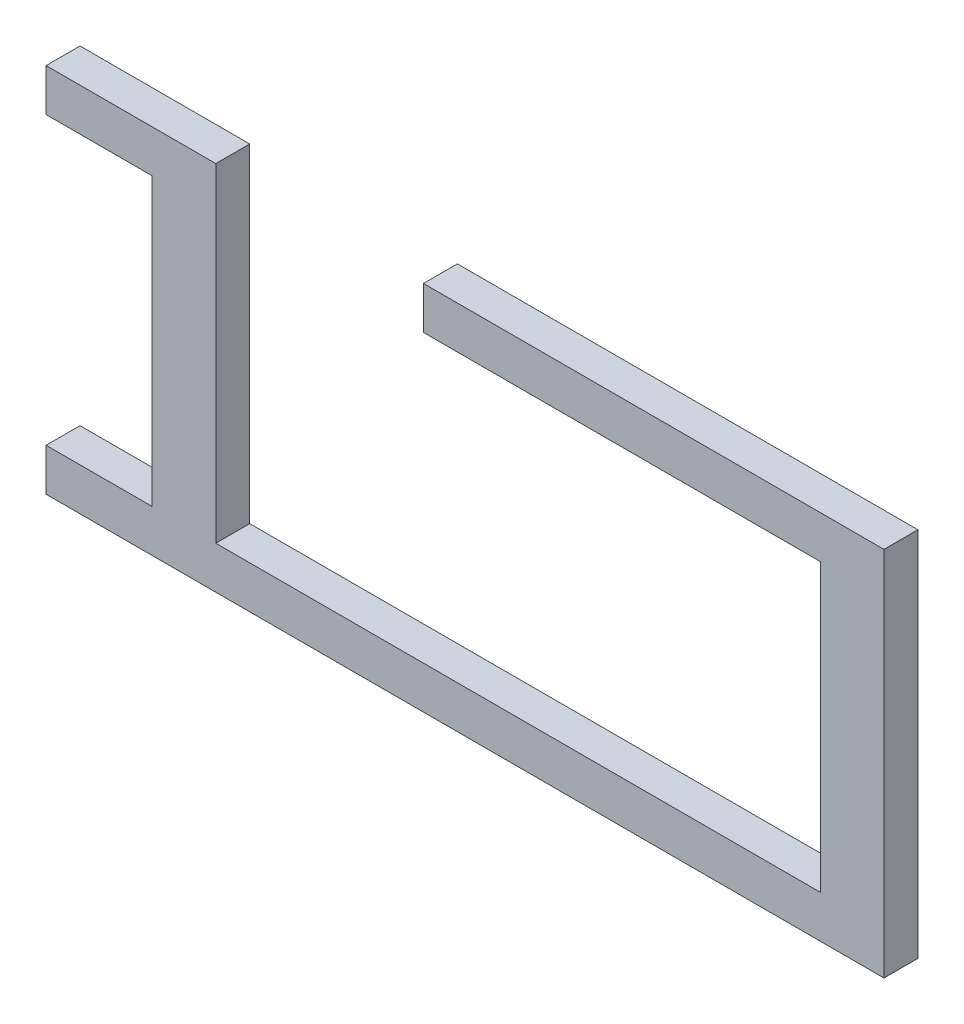
ISO-10303-21;
HEADER;
FILE_DESCRIPTION(('STEP AP214'),'2;1');
FILE_NAME('part.step','',(''),(''),'','','');
FILE_SCHEMA(('AUTOMOTIVE_DESIGN { 1 0 10303 214 1 1 1 1 }'));
ENDSEC;
DATA;
#1=APPLICATION_CONTEXT('core data for automotive mechanical design processes');
#2=APPLICATION_PROTOCOL_DEFINITION('international standard','automotive_design',2000,#1);
#3=PRODUCT_CONTEXT('',#1,'mechanical');
#4=PRODUCT('Part','Part','',(#3));
#5=PRODUCT_RELATED_PRODUCT_CATEGORY('part','',(#4));
#6=PRODUCT_DEFINITION_FORMATION('','',#4);
#7=PRODUCT_DEFINITION_CONTEXT('part definition',#1,'design');
#8=PRODUCT_DEFINITION('design','',#6,#7);
#9=PRODUCT_DEFINITION_SHAPE('','',#8);
#10=(LENGTH_UNIT() NAMED_UNIT(*) SI_UNIT(.MILLI.,.METRE.));
#11=(NAMED_UNIT(*) PLANE_ANGLE_UNIT() SI_UNIT($,.RADIAN.));
#12=(NAMED_UNIT(*) SI_UNIT($,.STERADIAN.) SOLID_ANGLE_UNIT());
#13=UNCERTAINTY_MEASURE_WITH_UNIT(LENGTH_MEASURE(1.E-05),#10,'distance_accuracy_value','');
#14=(GEOMETRIC_REPRESENTATION_CONTEXT(3) GLOBAL_UNCERTAINTY_ASSIGNED_CONTEXT((#13)) GLOBAL_UNIT_ASSIGNED_CONTEXT((#10,
#11,#12)) REPRESENTATION_CONTEXT('',''));
#15=CARTESIAN_POINT('',(0.,0.,0.));
#16=DIRECTION('',(0.,0.,1.));
#17=DIRECTION('',(1.,0.,0.));
#18=AXIS2_PLACEMENT_3D('',#15,#16,#17);
#19=CARTESIAN_POINT('',(14.6596099929362,3.20477089033923,1.6));
#20=DIRECTION('',(1.,0.,0.));
#21=DIRECTION('',(0.,1.,0.));
#22=AXIS2_PLACEMENT_3D('',#19,#20,#21);
#23=PLANE('',#22);
#24=DIRECTION('',(0.,-1.,0.));
#25=VECTOR('',#24,1.);
#26=CARTESIAN_POINT('',(14.6596099929362,3.20477089033923,0.));
#27=LINE('',#26,#25);
#28=CARTESIAN_POINT('',(14.6596099929362,3.20477089033923,0.));
#29=VERTEX_POINT('',#28);
#30=CARTESIAN_POINT('',(14.6596099929362,1.20477089033923,0.));
#31=VERTEX_POINT('',#30);
#32=EDGE_CURVE('E171',#29,#31,#27,.T.);
#33=ORIENTED_EDGE('',*,*,#32,.T.);
#34=DIRECTION('',(0.,0.,-1.));
#35=VECTOR('',#34,1.);
#36=CARTESIAN_POINT('',(14.6596099929362,1.20477089033923,1.6));
#37=LINE('',#36,#35);
#38=CARTESIAN_POINT('',(14.6596099929362,1.20477089033923,1.6));
#39=VERTEX_POINT('',#38);
#40=EDGE_CURVE('E11',#39,#31,#37,.T.);
#41=ORIENTED_EDGE('',*,*,#40,.F.);
#42=DIRECTION('',(0.,-1.,0.));
#43=VECTOR('',#42,1.);
#44=CARTESIAN_POINT('',(14.6596099929362,3.20477089033923,1.6));
#45=LINE('',#44,#43);
#46=CARTESIAN_POINT('',(14.6596099929362,3.20477089033923,1.6));
#47=VERTEX_POINT('',#46);
#48=EDGE_CURVE('E197',#47,#39,#45,.T.);
#49=ORIENTED_EDGE('',*,*,#48,.F.);
#50=DIRECTION('',(0.,0.,-1.));
#51=VECTOR('',#50,1.);
#52=CARTESIAN_POINT('',(14.6596099929362,3.20477089033923,1.6));
#53=LINE('',#52,#51);
#54=EDGE_CURVE('E167',#47,#29,#53,.T.);
#55=ORIENTED_EDGE('',*,*,#54,.T.);
#56=EDGE_LOOP('',(#33,#41,#49,#55));
#57=FACE_BOUND('',#56,.T.);
#58=ADVANCED_FACE('F39',(#57),#23,.F.);
#59=CARTESIAN_POINT('',(14.6596099929362,1.20477089033923,1.6));
#60=DIRECTION('',(0.,1.,0.));
#61=DIRECTION('',(0.,0.,1.));
#62=AXIS2_PLACEMENT_3D('',#59,#60,#61);
#63=PLANE('',#62);
#64=DIRECTION('',(1.,0.,0.));
#65=VECTOR('',#64,1.);
#66=CARTESIAN_POINT('',(14.6596099929362,1.20477089033923,0.));
#67=LINE('',#66,#65);
#68=CARTESIAN_POINT('',(33.3719358672992,1.20477089033923,0.));
#69=VERTEX_POINT('',#68);
#70=EDGE_CURVE('E174',#31,#69,#67,.T.);
#71=ORIENTED_EDGE('',*,*,#70,.T.);
#72=DIRECTION('',(0.,0.,-1.));
#73=VECTOR('',#72,1.);
#74=CARTESIAN_POINT('',(33.3719358672992,1.20477089033923,1.6));
#75=LINE('',#74,#73);
#76=CARTESIAN_POINT('',(33.3719358672992,1.20477089033923,1.6));
#77=VERTEX_POINT('',#76);
#78=EDGE_CURVE('E47',#77,#69,#75,.T.);
#79=ORIENTED_EDGE('',*,*,#78,.F.);
#80=DIRECTION('',(1.,0.,0.));
#81=VECTOR('',#80,1.);
#82=CARTESIAN_POINT('',(14.6596099929362,1.20477089033923,1.6));
#83=LINE('',#82,#81);
#84=EDGE_CURVE('E116',#39,#77,#83,.T.);
#85=ORIENTED_EDGE('',*,*,#84,.F.);
#86=ORIENTED_EDGE('',*,*,#40,.T.);
#87=EDGE_LOOP('',(#71,#79,#85,#86));
#88=FACE_BOUND('',#87,.T.);
#89=ADVANCED_FACE('F285',(#88),#63,.F.);
#90=CARTESIAN_POINT('',(33.3719358672992,1.20477089033923,1.6));
#91=DIRECTION('',(1.,0.,0.));
#92=DIRECTION('',(0.,0.,-1.));
#93=AXIS2_PLACEMENT_3D('',#90,#91,#92);
#94=PLANE('',#93);
#95=DIRECTION('',(0.,-1.,0.));
#96=VECTOR('',#95,1.);
#97=CARTESIAN_POINT('',(33.3719358672992,1.20477089033923,0.));
#98=LINE('',#97,#96);
#99=CARTESIAN_POINT('',(33.3719358672992,-12.2952291096608,0.));
#100=VERTEX_POINT('',#99);
#101=EDGE_CURVE('E176',#69,#100,#98,.T.);
#102=ORIENTED_EDGE('',*,*,#101,.T.);
#103=DIRECTION('',(0.,0.,-1.));
#104=VECTOR('',#103,1.);
#105=CARTESIAN_POINT('',(33.3719358672992,-12.2952291096608,1.6));
#106=LINE('',#105,#104);
#107=CARTESIAN_POINT('',(33.3719358672992,-12.2952291096608,1.6));
#108=VERTEX_POINT('',#107);
#109=EDGE_CURVE('E222',#108,#100,#106,.T.);
#110=ORIENTED_EDGE('',*,*,#109,.F.);
#111=DIRECTION('',(0.,-1.,0.));
#112=VECTOR('',#111,1.);
#113=CARTESIAN_POINT('',(33.3719358672992,1.20477089033923,1.6));
#114=LINE('',#113,#112);
#115=EDGE_CURVE('E230',#77,#108,#114,.T.);
#116=ORIENTED_EDGE('',*,*,#115,.F.);
#117=ORIENTED_EDGE('',*,*,#78,.T.);
#118=EDGE_LOOP('',(#102,#110,#116,#117));
#119=FACE_BOUND('',#118,.T.);
#120=ADVANCED_FACE('F228',(#119),#94,.F.);
#121=CARTESIAN_POINT('',(33.3719358672992,-12.2952291096608,1.6));
#122=DIRECTION('',(0.,-1.,0.));
#123=DIRECTION('',(1.,0.,0.));
#124=AXIS2_PLACEMENT_3D('',#121,#122,#123);
#125=PLANE('',#124);
#126=DIRECTION('',(-1.,0.,0.));
#127=VECTOR('',#126,1.);
#128=CARTESIAN_POINT('',(33.3719358672992,-12.2952291096608,0.));
#129=LINE('',#128,#127);
#130=CARTESIAN_POINT('',(4.87193586729921,-12.2952291096608,0.));
#131=VERTEX_POINT('',#130);
#132=EDGE_CURVE('E178',#100,#131,#129,.T.);
#133=ORIENTED_EDGE('',*,*,#132,.T.);
#134=DIRECTION('',(0.,0.,-1.));
#135=VECTOR('',#134,1.);
#136=CARTESIAN_POINT('',(4.87193586729921,-12.2952291096608,1.6));
#137=LINE('',#136,#135);
#138=CARTESIAN_POINT('',(4.87193586729921,-12.2952291096608,1.6));
#139=VERTEX_POINT('',#138);
#140=EDGE_CURVE('E219',#139,#131,#137,.T.);
#141=ORIENTED_EDGE('',*,*,#140,.F.);
#142=DIRECTION('',(-1.,0.,0.));
#143=VECTOR('',#142,1.);
#144=CARTESIAN_POINT('',(33.3719358672992,-12.2952291096608,1.6));
#145=LINE('',#144,#143);
#146=EDGE_CURVE('E248',#108,#139,#145,.T.);
#147=ORIENTED_EDGE('',*,*,#146,.F.);
#148=ORIENTED_EDGE('',*,*,#109,.T.);
#149=EDGE_LOOP('',(#133,#141,#147,#148));
#150=FACE_BOUND('',#149,.T.);
#151=ADVANCED_FACE('F239',(#150),#125,.F.);
#152=CARTESIAN_POINT('',(4.8719358672992,3.20477089033923,1.6));
#153=DIRECTION('',(-1.,0.,0.));
#154=DIRECTION('',(0.,-1.,0.));
#155=AXIS2_PLACEMENT_3D('',#152,#153,#154);
#156=PLANE('',#155);
#157=DIRECTION('',(0.,1.,0.));
#158=VECTOR('',#157,1.);
#159=CARTESIAN_POINT('',(4.8719358672992,3.20477089033923,0.));
#160=LINE('',#159,#158);
#161=CARTESIAN_POINT('',(4.8719358672992,3.20477089033923,0.));
#162=VERTEX_POINT('',#161);
#163=EDGE_CURVE('E180',#131,#162,#160,.T.);
#164=ORIENTED_EDGE('',*,*,#163,.T.);
#165=DIRECTION('',(0.,0.,-1.));
#166=VECTOR('',#165,1.);
#167=CARTESIAN_POINT('',(4.8719358672992,3.20477089033923,1.6));
#168=LINE('',#167,#166);
#169=CARTESIAN_POINT('',(4.8719358672992,3.20477089033923,1.6));
#170=VERTEX_POINT('',#169);
#171=EDGE_CURVE('E216',#170,#162,#168,.T.);
#172=ORIENTED_EDGE('',*,*,#171,.F.);
#173=DIRECTION('',(0.,1.,0.));
#174=VECTOR('',#173,1.);
#175=CARTESIAN_POINT('',(4.8719358672992,3.20477089033923,1.6));
#176=LINE('',#175,#174);
#177=EDGE_CURVE('E245',#139,#170,#176,.T.);
#178=ORIENTED_EDGE('',*,*,#177,.F.);
#179=ORIENTED_EDGE('',*,*,#140,.T.);
#180=EDGE_LOOP('',(#164,#172,#178,#179));
#181=FACE_BOUND('',#180,.T.);
#182=ADVANCED_FACE('F243',(#181),#156,.F.);
#183=CARTESIAN_POINT('',(-3.1280641327008,3.20477089033923,1.6));
#184=DIRECTION('',(0.,-1.,0.));
#185=DIRECTION('',(0.,0.,-1.));
#186=AXIS2_PLACEMENT_3D('',#183,#184,#185);
#187=PLANE('',#186);
#188=DIRECTION('',(-1.,0.,0.));
#189=VECTOR('',#188,1.);
#190=CARTESIAN_POINT('',(-3.1280641327008,3.20477089033923,0.));
#191=LINE('',#190,#189);
#192=CARTESIAN_POINT('',(-3.1280641327008,3.20477089033923,0.));
#193=VERTEX_POINT('',#192);
#194=EDGE_CURVE('E182',#162,#193,#191,.T.);
#195=ORIENTED_EDGE('',*,*,#194,.T.);
#196=DIRECTION('',(0.,0.,-1.));
#197=VECTOR('',#196,1.);
#198=CARTESIAN_POINT('',(-3.1280641327008,3.20477089033923,1.6));
#199=LINE('',#198,#197);
#200=CARTESIAN_POINT('',(-3.1280641327008,3.20477089033923,1.6));
#201=VERTEX_POINT('',#200);
#202=EDGE_CURVE('E213',#201,#193,#199,.T.);
#203=ORIENTED_EDGE('',*,*,#202,.F.);
#204=DIRECTION('',(-1.,0.,0.));
#205=VECTOR('',#204,1.);
#206=CARTESIAN_POINT('',(-3.1280641327008,3.20477089033923,1.6));
#207=LINE('',#206,#205);
#208=EDGE_CURVE('E247',#170,#201,#207,.T.);
#209=ORIENTED_EDGE('',*,*,#208,.F.);
#210=ORIENTED_EDGE('',*,*,#171,.T.);
#211=EDGE_LOOP('',(#195,#203,#209,#210));
#212=FACE_BOUND('',#211,.T.);
#213=ADVANCED_FACE('F298',(#212),#187,.F.);
#214=CARTESIAN_POINT('',(-3.1280641327008,3.20477089033923,1.6));
#215=DIRECTION('',(1.,0.,0.));
#216=DIRECTION('',(0.,0.,-1.));
#217=AXIS2_PLACEMENT_3D('',#214,#215,#216);
#218=PLANE('',#217);
#219=DIRECTION('',(0.,-1.,0.));
#220=VECTOR('',#219,1.);
#221=CARTESIAN_POINT('',(-3.1280641327008,3.20477089033923,0.));
#222=LINE('',#221,#220);
#223=CARTESIAN_POINT('',(-3.1280641327008,1.20477089033923,0.));
#224=VERTEX_POINT('',#223);
#225=EDGE_CURVE('E184',#193,#224,#222,.T.);
#226=ORIENTED_EDGE('',*,*,#225,.T.);
#227=DIRECTION('',(0.,0.,-1.));
#228=VECTOR('',#227,1.);
#229=CARTESIAN_POINT('',(-3.1280641327008,1.20477089033923,1.6));
#230=LINE('',#229,#228);
#231=CARTESIAN_POINT('',(-3.1280641327008,1.20477089033923,1.6));
#232=VERTEX_POINT('',#231);
#233=EDGE_CURVE('E210',#232,#224,#230,.T.);
#234=ORIENTED_EDGE('',*,*,#233,.F.);
#235=DIRECTION('',(0.,-1.,0.));
#236=VECTOR('',#235,1.);
#237=CARTESIAN_POINT('',(-3.1280641327008,3.20477089033923,1.6));
#238=LINE('',#237,#236);
#239=EDGE_CURVE('E250',#201,#232,#238,.T.);
#240=ORIENTED_EDGE('',*,*,#239,.F.);
#241=ORIENTED_EDGE('',*,*,#202,.T.);
#242=EDGE_LOOP('',(#226,#234,#240,#241));
#243=FACE_BOUND('',#242,.T.);
#244=ADVANCED_FACE('F301',(#243),#218,.F.);
#245=CARTESIAN_POINT('',(-3.1280641327008,1.20477089033923,1.6));
#246=DIRECTION('',(0.,1.,0.));
#247=DIRECTION('',(0.,0.,1.));
#248=AXIS2_PLACEMENT_3D('',#245,#246,#247);
#249=PLANE('',#248);
#250=DIRECTION('',(1.,0.,0.));
#251=VECTOR('',#250,1.);
#252=CARTESIAN_POINT('',(-3.1280641327008,1.20477089033923,0.));
#253=LINE('',#252,#251);
#254=CARTESIAN_POINT('',(1.8719358672992,1.20477089033923,0.));
#255=VERTEX_POINT('',#254);
#256=EDGE_CURVE('E186',#224,#255,#253,.T.);
#257=ORIENTED_EDGE('',*,*,#256,.T.);
#258=DIRECTION('',(0.,0.,-1.));
#259=VECTOR('',#258,1.);
#260=CARTESIAN_POINT('',(1.8719358672992,1.20477089033923,1.6));
#261=LINE('',#260,#259);
#262=CARTESIAN_POINT('',(1.8719358672992,1.20477089033923,1.6));
#263=VERTEX_POINT('',#262);
#264=EDGE_CURVE('E207',#263,#255,#261,.T.);
#265=ORIENTED_EDGE('',*,*,#264,.F.);
#266=DIRECTION('',(1.,0.,0.));
#267=VECTOR('',#266,1.);
#268=CARTESIAN_POINT('',(-3.1280641327008,1.20477089033923,1.6));
#269=LINE('',#268,#267);
#270=EDGE_CURVE('E256',#232,#263,#269,.T.);
#271=ORIENTED_EDGE('',*,*,#270,.F.);
#272=ORIENTED_EDGE('',*,*,#233,.T.);
#273=EDGE_LOOP('',(#257,#265,#271,#272));
#274=FACE_BOUND('',#273,.T.);
#275=ADVANCED_FACE('F305',(#274),#249,.F.);
#276=CARTESIAN_POINT('',(1.8719358672992,1.20477089033923,1.6));
#277=DIRECTION('',(1.,0.,0.));
#278=DIRECTION('',(0.,1.,0.));
#279=AXIS2_PLACEMENT_3D('',#276,#277,#278);
#280=PLANE('',#279);
#281=DIRECTION('',(0.,-1.,0.));
#282=VECTOR('',#281,1.);
#283=CARTESIAN_POINT('',(1.8719358672992,1.20477089033923,0.));
#284=LINE('',#283,#282);
#285=CARTESIAN_POINT('',(1.87193586729921,-12.2952291096608,0.));
#286=VERTEX_POINT('',#285);
#287=EDGE_CURVE('E188',#255,#286,#284,.T.);
#288=ORIENTED_EDGE('',*,*,#287,.T.);
#289=DIRECTION('',(0.,0.,-1.));
#290=VECTOR('',#289,1.);
#291=CARTESIAN_POINT('',(1.87193586729921,-12.2952291096608,1.6));
#292=LINE('',#291,#290);
#293=CARTESIAN_POINT('',(1.87193586729921,-12.2952291096608,1.6));
#294=VERTEX_POINT('',#293);
#295=EDGE_CURVE('E204',#294,#286,#292,.T.);
#296=ORIENTED_EDGE('',*,*,#295,.F.);
#297=DIRECTION('',(0.,-1.,0.));
#298=VECTOR('',#297,1.);
#299=CARTESIAN_POINT('',(1.8719358672992,1.20477089033923,1.6));
#300=LINE('',#299,#298);
#301=EDGE_CURVE('E258',#263,#294,#300,.T.);
#302=ORIENTED_EDGE('',*,*,#301,.F.);
#303=ORIENTED_EDGE('',*,*,#264,.T.);
#304=EDGE_LOOP('',(#288,#296,#302,#303));
#305=FACE_BOUND('',#304,.T.);
#306=ADVANCED_FACE('F309',(#305),#280,.F.);
#307=CARTESIAN_POINT('',(1.87193586729921,-12.2952291096608,1.6));
#308=DIRECTION('',(0.,-1.,0.));
#309=DIRECTION('',(1.,0.,0.));
#310=AXIS2_PLACEMENT_3D('',#307,#308,#309);
#311=PLANE('',#310);
#312=DIRECTION('',(-1.,0.,0.));
#313=VECTOR('',#312,1.);
#314=CARTESIAN_POINT('',(1.87193586729921,-12.2952291096608,0.));
#315=LINE('',#314,#313);
#316=CARTESIAN_POINT('',(-3.1280641327008,-12.2952291096608,0.));
#317=VERTEX_POINT('',#316);
#318=EDGE_CURVE('E190',#286,#317,#315,.T.);
#319=ORIENTED_EDGE('',*,*,#318,.T.);
#320=DIRECTION('',(0.,0.,-1.));
#321=VECTOR('',#320,1.);
#322=CARTESIAN_POINT('',(-3.1280641327008,-12.2952291096608,1.6));
#323=LINE('',#322,#321);
#324=CARTESIAN_POINT('',(-3.1280641327008,-12.2952291096608,1.6));
#325=VERTEX_POINT('',#324);
#326=EDGE_CURVE('E201',#325,#317,#323,.T.);
#327=ORIENTED_EDGE('',*,*,#326,.F.);
#328=DIRECTION('',(-1.,0.,0.));
#329=VECTOR('',#328,1.);
#330=CARTESIAN_POINT('',(1.87193586729921,-12.2952291096608,1.6));
#331=LINE('',#330,#329);
#332=EDGE_CURVE('E260',#294,#325,#331,.T.);
#333=ORIENTED_EDGE('',*,*,#332,.F.);
#334=ORIENTED_EDGE('',*,*,#295,.T.);
#335=EDGE_LOOP('',(#319,#327,#333,#334));
#336=FACE_BOUND('',#335,.T.);
#337=ADVANCED_FACE('F266',(#336),#311,.F.);
#338=CARTESIAN_POINT('',(-3.1280641327008,-14.2952291096608,1.6));
#339=DIRECTION('',(1.,0.,0.));
#340=DIRECTION('',(0.,0.,-1.));
#341=AXIS2_PLACEMENT_3D('',#338,#339,#340);
#342=PLANE('',#341);
#343=DIRECTION('',(0.,-1.,0.));
#344=VECTOR('',#343,1.);
#345=CARTESIAN_POINT('',(-3.1280641327008,-14.2952291096608,0.));
#346=LINE('',#345,#344);
#347=CARTESIAN_POINT('',(-3.1280641327008,-14.2952291096608,0.));
#348=VERTEX_POINT('',#347);
#349=EDGE_CURVE('E192',#317,#348,#346,.T.);
#350=ORIENTED_EDGE('',*,*,#349,.T.);
#351=DIRECTION('',(0.,0.,-1.));
#352=VECTOR('',#351,1.);
#353=CARTESIAN_POINT('',(-3.1280641327008,-14.2952291096608,1.6));
#354=LINE('',#353,#352);
#355=CARTESIAN_POINT('',(-3.1280641327008,-14.2952291096608,1.6));
#356=VERTEX_POINT('',#355);
#357=EDGE_CURVE('E162',#356,#348,#354,.T.);
#358=ORIENTED_EDGE('',*,*,#357,.F.);
#359=DIRECTION('',(0.,-1.,0.));
#360=VECTOR('',#359,1.);
#361=CARTESIAN_POINT('',(-3.1280641327008,-14.2952291096608,1.6));
#362=LINE('',#361,#360);
#363=EDGE_CURVE('E153',#325,#356,#362,.T.);
#364=ORIENTED_EDGE('',*,*,#363,.F.);
#365=ORIENTED_EDGE('',*,*,#326,.T.);
#366=EDGE_LOOP('',(#350,#358,#364,#365));
#367=FACE_BOUND('',#366,.T.);
#368=ADVANCED_FACE('F270',(#367),#342,.F.);
#369=CARTESIAN_POINT('',(36.3719358672992,-14.2952291096608,1.6));
#370=DIRECTION('',(0.,1.,0.));
#371=DIRECTION('',(-1.,0.,0.));
#372=AXIS2_PLACEMENT_3D('',#369,#370,#371);
#373=PLANE('',#372);
#374=DIRECTION('',(1.,0.,0.));
#375=VECTOR('',#374,1.);
#376=CARTESIAN_POINT('',(36.3719358672992,-14.2952291096608,0.));
#377=LINE('',#376,#375);
#378=CARTESIAN_POINT('',(36.3719358672992,-14.2952291096608,0.));
#379=VERTEX_POINT('',#378);
#380=EDGE_CURVE('E161',#348,#379,#377,.T.);
#381=ORIENTED_EDGE('',*,*,#380,.T.);
#382=DIRECTION('',(0.,0.,-1.));
#383=VECTOR('',#382,1.);
#384=CARTESIAN_POINT('',(36.3719358672992,-14.2952291096608,1.6));
#385=LINE('',#384,#383);
#386=CARTESIAN_POINT('',(36.3719358672992,-14.2952291096608,1.6));
#387=VERTEX_POINT('',#386);
#388=EDGE_CURVE('E158',#387,#379,#385,.T.);
#389=ORIENTED_EDGE('',*,*,#388,.F.);
#390=DIRECTION('',(1.,0.,0.));
#391=VECTOR('',#390,1.);
#392=CARTESIAN_POINT('',(36.3719358672992,-14.2952291096608,1.6));
#393=LINE('',#392,#391);
#394=EDGE_CURVE('E147',#356,#387,#393,.T.);
#395=ORIENTED_EDGE('',*,*,#394,.F.);
#396=ORIENTED_EDGE('',*,*,#357,.T.);
#397=EDGE_LOOP('',(#381,#389,#395,#396));
#398=FACE_BOUND('',#397,.T.);
#399=ADVANCED_FACE('F159',(#398),#373,.F.);
#400=CARTESIAN_POINT('',(36.3719358672992,3.20477089033923,1.6));
#401=DIRECTION('',(-1.,0.,0.));
#402=DIRECTION('',(0.,0.,1.));
#403=AXIS2_PLACEMENT_3D('',#400,#401,#402);
#404=PLANE('',#403);
#405=DIRECTION('',(0.,1.,0.));
#406=VECTOR('',#405,1.);
#407=CARTESIAN_POINT('',(36.3719358672992,3.20477089033923,0.));
#408=LINE('',#407,#406);
#409=CARTESIAN_POINT('',(36.3719358672992,3.20477089033923,0.));
#410=VERTEX_POINT('',#409);
#411=EDGE_CURVE('E102',#379,#410,#408,.T.);
#412=ORIENTED_EDGE('',*,*,#411,.T.);
#413=DIRECTION('',(0.,0.,-1.));
#414=VECTOR('',#413,1.);
#415=CARTESIAN_POINT('',(36.3719358672992,3.20477089033923,1.6));
#416=LINE('',#415,#414);
#417=CARTESIAN_POINT('',(36.3719358672992,3.20477089033923,1.6));
#418=VERTEX_POINT('',#417);
#419=EDGE_CURVE('E163',#418,#410,#416,.T.);
#420=ORIENTED_EDGE('',*,*,#419,.F.);
#421=DIRECTION('',(0.,1.,0.));
#422=VECTOR('',#421,1.);
#423=CARTESIAN_POINT('',(36.3719358672992,3.20477089033923,1.6));
#424=LINE('',#423,#422);
#425=EDGE_CURVE('E151',#387,#418,#424,.T.);
#426=ORIENTED_EDGE('',*,*,#425,.F.);
#427=ORIENTED_EDGE('',*,*,#388,.T.);
#428=EDGE_LOOP('',(#412,#420,#426,#427));
#429=FACE_BOUND('',#428,.T.);
#430=ADVANCED_FACE('F165',(#429),#404,.F.);
#431=CARTESIAN_POINT('',(14.6596099929362,3.20477089033923,1.6));
#432=DIRECTION('',(0.,-1.,0.));
#433=DIRECTION('',(0.,0.,-1.));
#434=AXIS2_PLACEMENT_3D('',#431,#432,#433);
#435=PLANE('',#434);
#436=DIRECTION('',(-1.,0.,0.));
#437=VECTOR('',#436,1.);
#438=CARTESIAN_POINT('',(14.6596099929362,3.20477089033923,0.));
#439=LINE('',#438,#437);
#440=EDGE_CURVE('E108',#410,#29,#439,.T.);
#441=ORIENTED_EDGE('',*,*,#440,.T.);
#442=ORIENTED_EDGE('',*,*,#54,.F.);
#443=DIRECTION('',(-1.,0.,0.));
#444=VECTOR('',#443,1.);
#445=CARTESIAN_POINT('',(14.6596099929362,3.20477089033923,1.6));
#446=LINE('',#445,#444);
#447=EDGE_CURVE('E55',#418,#47,#446,.T.);
#448=ORIENTED_EDGE('',*,*,#447,.F.);
#449=ORIENTED_EDGE('',*,*,#419,.T.);
#450=EDGE_LOOP('',(#441,#442,#448,#449));
#451=FACE_BOUND('',#450,.T.);
#452=ADVANCED_FACE('F274',(#451),#435,.F.);
#453=CARTESIAN_POINT('',(0.,0.,1.6));
#454=DIRECTION('',(0.,0.,1.));
#455=DIRECTION('',(1.,0.,0.));
#456=AXIS2_PLACEMENT_3D('',#453,#454,#455);
#457=PLANE('',#456);
#458=ORIENTED_EDGE('',*,*,#48,.T.);
#459=ORIENTED_EDGE('',*,*,#84,.T.);
#460=ORIENTED_EDGE('',*,*,#115,.T.);
#461=ORIENTED_EDGE('',*,*,#146,.T.);
#462=ORIENTED_EDGE('',*,*,#177,.T.);
#463=ORIENTED_EDGE('',*,*,#208,.T.);
#464=ORIENTED_EDGE('',*,*,#239,.T.);
#465=ORIENTED_EDGE('',*,*,#270,.T.);
#466=ORIENTED_EDGE('',*,*,#301,.T.);
#467=ORIENTED_EDGE('',*,*,#332,.T.);
#468=ORIENTED_EDGE('',*,*,#363,.T.);
#469=ORIENTED_EDGE('',*,*,#394,.T.);
#470=ORIENTED_EDGE('',*,*,#425,.T.);
#471=ORIENTED_EDGE('',*,*,#447,.T.);
#472=EDGE_LOOP('',(#458,#459,#460,#461,#462,#463,#464,#465,#466,#467,#468,#469,#470,#471));
#473=FACE_BOUND('',#472,.T.);
#474=ADVANCED_FACE('F149',(#473),#457,.T.);
#475=CARTESIAN_POINT('',(0.,0.,0.));
#476=DIRECTION('',(0.,0.,1.));
#477=DIRECTION('',(1.,0.,0.));
#478=AXIS2_PLACEMENT_3D('',#475,#476,#477);
#479=PLANE('',#478);
#480=ORIENTED_EDGE('',*,*,#32,.F.);
#481=ORIENTED_EDGE('',*,*,#440,.F.);
#482=ORIENTED_EDGE('',*,*,#411,.F.);
#483=ORIENTED_EDGE('',*,*,#380,.F.);
#484=ORIENTED_EDGE('',*,*,#349,.F.);
#485=ORIENTED_EDGE('',*,*,#318,.F.);
#486=ORIENTED_EDGE('',*,*,#287,.F.);
#487=ORIENTED_EDGE('',*,*,#256,.F.);
#488=ORIENTED_EDGE('',*,*,#225,.F.);
#489=ORIENTED_EDGE('',*,*,#194,.F.);
#490=ORIENTED_EDGE('',*,*,#163,.F.);
#491=ORIENTED_EDGE('',*,*,#132,.F.);
#492=ORIENTED_EDGE('',*,*,#101,.F.);
#493=ORIENTED_EDGE('',*,*,#70,.F.);
#494=EDGE_LOOP('',(#480,#481,#482,#483,#484,#485,#486,#487,#488,#489,#490,#491,#492,#493));
#495=FACE_BOUND('',#494,.T.);
#496=ADVANCED_FACE('F234',(#495),#479,.F.);
#497=CLOSED_SHELL('',(#58,#89,#120,#151,#182,#213,#244,#275,#306,#337,#368,#399,#430,#452,#474,#496));
#498=MANIFOLD_SOLID_BREP('B2',#497);
#499=ADVANCED_BREP_SHAPE_REPRESENTATION('',(#18,#498),#14);
#500=SHAPE_DEFINITION_REPRESENTATION(#9,#499);
ENDSEC;
END-ISO-10303-21;
